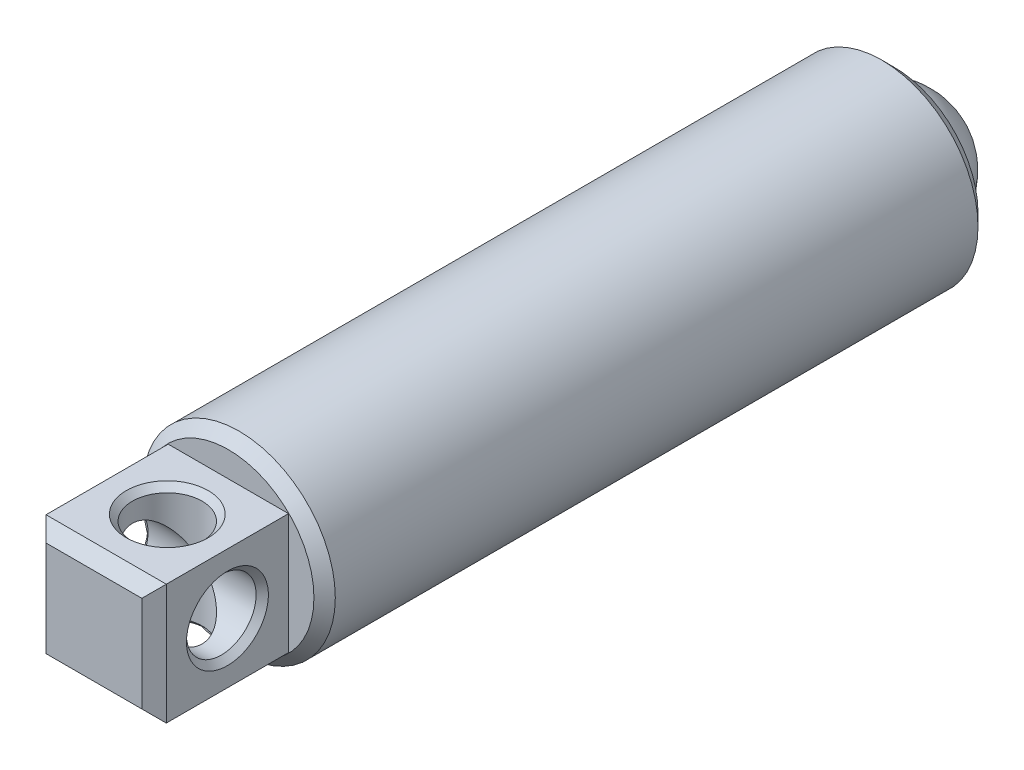
ISO-10303-21;
HEADER;
FILE_DESCRIPTION(('STEP AP214'),'2;1');
FILE_NAME('part.step','',(''),(''),'','','');
FILE_SCHEMA(('AUTOMOTIVE_DESIGN { 1 0 10303 214 1 1 1 1 }'));
ENDSEC;
DATA;
#1=APPLICATION_CONTEXT('core data for automotive mechanical design processes');
#2=APPLICATION_PROTOCOL_DEFINITION('international standard','automotive_design',2000,#1);
#3=PRODUCT_CONTEXT('',#1,'mechanical');
#4=PRODUCT('Part','Part','',(#3));
#5=PRODUCT_RELATED_PRODUCT_CATEGORY('part','',(#4));
#6=PRODUCT_DEFINITION_FORMATION('','',#4);
#7=PRODUCT_DEFINITION_CONTEXT('part definition',#1,'design');
#8=PRODUCT_DEFINITION('design','',#6,#7);
#9=PRODUCT_DEFINITION_SHAPE('','',#8);
#10=(LENGTH_UNIT() NAMED_UNIT(*) SI_UNIT(.MILLI.,.METRE.));
#11=(NAMED_UNIT(*) PLANE_ANGLE_UNIT() SI_UNIT($,.RADIAN.));
#12=(NAMED_UNIT(*) SI_UNIT($,.STERADIAN.) SOLID_ANGLE_UNIT());
#13=UNCERTAINTY_MEASURE_WITH_UNIT(LENGTH_MEASURE(1.E-05),#10,'distance_accuracy_value','');
#14=(GEOMETRIC_REPRESENTATION_CONTEXT(3) GLOBAL_UNCERTAINTY_ASSIGNED_CONTEXT((#13)) GLOBAL_UNIT_ASSIGNED_CONTEXT((#10,
#11,#12)) REPRESENTATION_CONTEXT('',''));
#15=CARTESIAN_POINT('',(0.,0.,0.));
#16=DIRECTION('',(0.,0.,1.));
#17=DIRECTION('',(1.,0.,0.));
#18=AXIS2_PLACEMENT_3D('',#15,#16,#17);
#19=CARTESIAN_POINT('',(1.6625129625254,-2.46036743646982,-6.2258856071015));
#20=DIRECTION('',(0.0490590695989106,0.998795878891222,0.));
#21=DIRECTION('',(-0.998795878891222,0.0490590695989106,0.));
#22=AXIS2_PLACEMENT_3D('',#19,#20,#21);
#23=SPHERICAL_SURFACE('',#22,1.3890625);
#24=CARTESIAN_POINT('',(1.6625129625254,-2.46036743646982,-6.2258856071015));
#25=DIRECTION('',(-0.0490590695989109,-0.998795878891222,0.));
#26=DIRECTION('',(0.,0.,-1.));
#27=AXIS2_PLACEMENT_3D('',#24,#25,#26);
#28=CIRCLE('',#27,1.3890625);
#29=CARTESIAN_POINT('',(0.27512306200306,-2.39222132260509,-6.2258856071015));
#30=VERTEX_POINT('',#29);
#31=CARTESIAN_POINT('',(3.04990286304774,-2.52851355033456,-6.2258856071015));
#32=VERTEX_POINT('',#31);
#33=EDGE_CURVE('P0_E38',#30,#32,#28,.T.);
#34=ORIENTED_EDGE('',*,*,#33,.T.);
#35=CARTESIAN_POINT('',(1.6625129625254,-2.46036743646982,-6.2258856071015));
#36=DIRECTION('',(0.,0.,-1.));
#37=DIRECTION('',(-0.998795878891222,0.0490590695989109,0.));
#38=AXIS2_PLACEMENT_3D('',#35,#36,#37);
#39=CIRCLE('',#38,1.3890625);
#40=EDGE_CURVE('P0_E11',#32,#30,#39,.T.);
#41=ORIENTED_EDGE('',*,*,#40,.T.);
#42=EDGE_LOOP('',(#34,#41));
#43=FACE_BOUND('',#42,.T.);
#44=ADVANCED_FACE('P0_F16',(#43),#23,.T.);
#45=ORIENTED_EDGE('',*,*,#33,.F.);
#46=CARTESIAN_POINT('',(1.6625129625254,-2.46036743646982,-6.2258856071015));
#47=DIRECTION('',(0.,0.,-1.));
#48=DIRECTION('',(-0.998795878891222,0.0490590695989109,0.));
#49=AXIS2_PLACEMENT_3D('',#46,#47,#48);
#50=CIRCLE('',#49,1.3890625);
#51=EDGE_CURVE('P0_E23',#30,#32,#50,.T.);
#52=ORIENTED_EDGE('',*,*,#51,.T.);
#53=EDGE_LOOP('',(#45,#52));
#54=FACE_BOUND('',#53,.T.);
#55=ADVANCED_FACE('P0_F37',(#54),#23,.T.);
#56=ORIENTED_EDGE('',*,*,#40,.F.);
#57=EDGE_CURVE('P0_E34',#32,#30,#28,.T.);
#58=ORIENTED_EDGE('',*,*,#57,.T.);
#59=EDGE_LOOP('',(#56,#58));
#60=FACE_BOUND('',#59,.T.);
#61=ADVANCED_FACE('P0_F32',(#60),#23,.T.);
#62=ORIENTED_EDGE('',*,*,#51,.F.);
#63=ORIENTED_EDGE('',*,*,#57,.F.);
#64=EDGE_LOOP('',(#62,#63));
#65=FACE_BOUND('',#64,.T.);
#66=ADVANCED_FACE('P0_F18',(#65),#23,.T.);
#67=CLOSED_SHELL('',(#44,#55,#61,#66));
#68=MANIFOLD_SOLID_BREP('P0_B1',#67);
#69=CARTESIAN_POINT('',(-0.337483037474602,-2.46036743646982,8.6550518928985));
#70=DIRECTION('',(1.,0.,0.));
#71=DIRECTION('',(0.,0.,-1.));
#72=AXIS2_PLACEMENT_3D('',#69,#70,#71);
#73=CYLINDRICAL_SURFACE('',#72,0.7239);
#74=CARTESIAN_POINT('',(2.7855129625254,-2.46036743646982,8.6550518928985));
#75=DIRECTION('',(-1.,0.,0.));
#76=DIRECTION('',(0.,0.,1.));
#77=AXIS2_PLACEMENT_3D('',#74,#75,#76);
#78=CIRCLE('',#77,0.7239);
#79=CARTESIAN_POINT('',(2.7855129625254,-2.46036743646982,9.3789518928985));
#80=VERTEX_POINT('',#79);
#81=EDGE_CURVE('P1_E119',#80,#80,#78,.F.);
#82=ORIENTED_EDGE('',*,*,#81,.T.);
#83=EDGE_LOOP('',(#82));
#84=FACE_BOUND('',#83,.T.);
#85=CARTESIAN_POINT('',(1.6625129625254,-2.46036743646982,8.6550518928985));
#86=DIRECTION('',(0.707106781186547,-0.707106781186547,0.));
#87=DIRECTION('',(0.707106781186547,0.707106781186547,0.));
#88=AXIS2_PLACEMENT_3D('',#85,#86,#87);
#89=ELLIPSE('',#88,1.02374919780188,0.7239);
#90=CARTESIAN_POINT('',(1.6625129625254,-2.46036743646982,9.3789518928985));
#91=VERTEX_POINT('',#90);
#92=CARTESIAN_POINT('',(1.6625129625254,-2.46036743646982,7.9311518928985));
#93=VERTEX_POINT('',#92);
#94=EDGE_CURVE('P1_E86',#91,#93,#89,.F.);
#95=ORIENTED_EDGE('',*,*,#94,.T.);
#96=CARTESIAN_POINT('',(1.6625129625254,-2.46036743646982,8.6550518928985));
#97=DIRECTION('',(0.707106781186547,0.707106781186547,0.));
#98=DIRECTION('',(0.707106781186547,-0.707106781186547,0.));
#99=AXIS2_PLACEMENT_3D('',#96,#97,#98);
#100=ELLIPSE('',#99,1.02374919780188,0.7239);
#101=EDGE_CURVE('P1_E82',#93,#91,#100,.F.);
#102=ORIENTED_EDGE('',*,*,#101,.T.);
#103=EDGE_LOOP('',(#95,#102));
#104=FACE_BOUND('',#103,.T.);
#105=ADVANCED_FACE('P1_F15',(#84,#104),#73,.F.);
#106=CARTESIAN_POINT('',(1.6625129625254,-0.682367436469824,7.3850518928985));
#107=DIRECTION('',(0.,0.,-1.));
#108=DIRECTION('',(-1.,0.,0.));
#109=AXIS2_PLACEMENT_3D('',#106,#107,#108);
#110=PLANE('',#109);
#111=CARTESIAN_POINT('',(1.6625129625254,-2.46036743646982,7.3850518928985));
#112=DIRECTION('',(0.,0.,1.));
#113=DIRECTION('',(1.,0.,0.));
#114=AXIS2_PLACEMENT_3D('',#111,#112,#113);
#115=CIRCLE('',#114,1.778);
#116=CARTESIAN_POINT('',(3.4405129625254,-2.46036743646982,7.3850518928985));
#117=VERTEX_POINT('',#116);
#118=EDGE_CURVE('P1_E178',#117,#117,#115,.T.);
#119=ORIENTED_EDGE('',*,*,#118,.T.);
#120=EDGE_LOOP('',(#119));
#121=FACE_BOUND('',#120,.T.);
#122=DIRECTION('',(0.,1.,0.));
#123=VECTOR('',#122,1.);
#124=CARTESIAN_POINT('',(2.9125129625254,-3.71036743646982,7.3850518928985));
#125=LINE('',#124,#123);
#126=CARTESIAN_POINT('',(2.9125129625254,-3.71036743646982,7.3850518928985));
#127=VERTEX_POINT('',#126);
#128=CARTESIAN_POINT('',(2.9125129625254,-1.21036743646982,7.3850518928985));
#129=VERTEX_POINT('',#128);
#130=EDGE_CURVE('P1_E152',#127,#129,#125,.T.);
#131=ORIENTED_EDGE('',*,*,#130,.F.);
#132=DIRECTION('',(1.,0.,0.));
#133=VECTOR('',#132,1.);
#134=CARTESIAN_POINT('',(0.412512962525397,-3.71036743646982,7.3850518928985));
#135=LINE('',#134,#133);
#136=CARTESIAN_POINT('',(0.412512962525397,-3.71036743646982,7.3850518928985));
#137=VERTEX_POINT('',#136);
#138=EDGE_CURVE('P1_E167',#137,#127,#135,.T.);
#139=ORIENTED_EDGE('',*,*,#138,.F.);
#140=DIRECTION('',(0.,-1.,0.));
#141=VECTOR('',#140,1.);
#142=CARTESIAN_POINT('',(0.412512962525397,-3.71036743646982,7.3850518928985));
#143=LINE('',#142,#141);
#144=CARTESIAN_POINT('',(0.412512962525397,-1.21036743646982,7.3850518928985));
#145=VERTEX_POINT('',#144);
#146=EDGE_CURVE('P1_E162',#145,#137,#143,.T.);
#147=ORIENTED_EDGE('',*,*,#146,.F.);
#148=DIRECTION('',(-1.,0.,0.));
#149=VECTOR('',#148,1.);
#150=CARTESIAN_POINT('',(0.412512962525397,-1.21036743646982,7.3850518928985));
#151=LINE('',#150,#149);
#152=EDGE_CURVE('P1_E157',#129,#145,#151,.T.);
#153=ORIENTED_EDGE('',*,*,#152,.F.);
#154=EDGE_LOOP('',(#131,#139,#147,#153));
#155=FACE_BOUND('',#154,.T.);
#156=ADVANCED_FACE('P1_F195',(#121,#155),#110,.F.);
#157=CARTESIAN_POINT('',(1.6625129625254,-2.46036743646982,-4.26145458061761));
#158=DIRECTION('',(0.,0.,-1.));
#159=DIRECTION('',(-1.,0.,0.));
#160=AXIS2_PLACEMENT_3D('',#157,#158,#159);
#161=CONICAL_SURFACE('',#160,0.,0.785398163397444);
#162=CARTESIAN_POINT('',(1.6625129625254,-2.46036743646982,-5.65845458061762));
#163=DIRECTION('',(0.,0.,1.));
#164=DIRECTION('',(1.,0.,0.));
#165=AXIS2_PLACEMENT_3D('',#162,#163,#164);
#166=CIRCLE('',#165,1.397);
#167=CARTESIAN_POINT('',(3.0595129625254,-2.46036743646982,-5.65845458061762));
#168=VERTEX_POINT('',#167);
#169=EDGE_CURVE('P1_E92',#168,#168,#166,.T.);
#170=ORIENTED_EDGE('',*,*,#169,.F.);
#171=EDGE_LOOP('',(#170));
#172=FACE_BOUND('',#171,.T.);
#173=CARTESIAN_POINT('',(1.6625129625254,-2.46036743646982,-4.26145458061761));
#174=VERTEX_POINT('',#173);
#175=VERTEX_LOOP('',#174);
#176=FACE_BOUND('',#175,.T.);
#177=ADVANCED_FACE('P1_F192',(#172,#176),#161,.F.);
#178=CARTESIAN_POINT('',(1.6625129625254,-2.46036743646982,7.3850518928985));
#179=DIRECTION('',(0.,0.,1.));
#180=DIRECTION('',(1.,0.,0.));
#181=AXIS2_PLACEMENT_3D('',#178,#179,#180);
#182=CYLINDRICAL_SURFACE('',#181,1.397);
#183=CARTESIAN_POINT('',(1.6625129625254,-2.46036743646982,-6.4465481071015));
#184=DIRECTION('',(0.,0.,1.));
#185=DIRECTION('',(1.,0.,0.));
#186=AXIS2_PLACEMENT_3D('',#183,#184,#185);
#187=CIRCLE('',#186,1.397);
#188=CARTESIAN_POINT('',(3.0595129625254,-2.46036743646982,-6.4465481071015));
#189=VERTEX_POINT('',#188);
#190=EDGE_CURVE('P1_E184',#189,#189,#187,.T.);
#191=ORIENTED_EDGE('',*,*,#190,.F.);
#192=EDGE_LOOP('',(#191));
#193=FACE_BOUND('',#192,.T.);
#194=ORIENTED_EDGE('',*,*,#169,.T.);
#195=EDGE_LOOP('',(#194));
#196=FACE_BOUND('',#195,.T.);
#197=ADVANCED_FACE('P1_F190',(#193,#196),#182,.F.);
#198=CARTESIAN_POINT('',(1.6625129625254,-0.460371436469824,-6.4465481071015));
#199=DIRECTION('',(0.,0.,1.));
#200=DIRECTION('',(1.,0.,0.));
#201=AXIS2_PLACEMENT_3D('',#198,#199,#200);
#202=PLANE('',#201);
#203=CARTESIAN_POINT('',(1.6625129625254,-2.46036743646982,-6.4465481071015));
#204=DIRECTION('',(0.,0.,1.));
#205=DIRECTION('',(1.,0.,0.));
#206=AXIS2_PLACEMENT_3D('',#203,#204,#205);
#207=CIRCLE('',#206,1.745996);
#208=CARTESIAN_POINT('',(3.4085089625254,-2.46036743646982,-6.4465481071015));
#209=VERTEX_POINT('',#208);
#210=EDGE_CURVE('P1_E101',#209,#209,#207,.F.);
#211=ORIENTED_EDGE('',*,*,#210,.T.);
#212=EDGE_LOOP('',(#211));
#213=FACE_BOUND('',#212,.T.);
#214=ORIENTED_EDGE('',*,*,#190,.T.);
#215=EDGE_LOOP('',(#214));
#216=FACE_BOUND('',#215,.T.);
#217=ADVANCED_FACE('P1_F202',(#213,#216),#202,.F.);
#218=CARTESIAN_POINT('',(1.6625129625254,-2.46036743646982,7.3850518928985));
#219=DIRECTION('',(0.,0.,1.));
#220=DIRECTION('',(1.,0.,0.));
#221=AXIS2_PLACEMENT_3D('',#218,#219,#220);
#222=CYLINDRICAL_SURFACE('',#221,1.999996);
#223=CARTESIAN_POINT('',(1.6625129625254,-2.46036743646982,-6.1925481071015));
#224=DIRECTION('',(0.,0.,1.));
#225=DIRECTION('',(1.,0.,0.));
#226=AXIS2_PLACEMENT_3D('',#223,#224,#225);
#227=CIRCLE('',#226,1.999996);
#228=CARTESIAN_POINT('',(3.6625089625254,-2.46036743646982,-6.1925481071015));
#229=VERTEX_POINT('',#228);
#230=EDGE_CURVE('P1_E94',#229,#229,#227,.T.);
#231=ORIENTED_EDGE('',*,*,#230,.T.);
#232=EDGE_LOOP('',(#231));
#233=FACE_BOUND('',#232,.T.);
#234=CARTESIAN_POINT('',(1.6625129625254,-2.46036743646982,7.1630558928985));
#235=DIRECTION('',(0.,0.,1.));
#236=DIRECTION('',(1.,0.,0.));
#237=AXIS2_PLACEMENT_3D('',#234,#235,#236);
#238=CIRCLE('',#237,1.999996);
#239=CARTESIAN_POINT('',(3.6625089625254,-2.46036743646982,7.1630558928985));
#240=VERTEX_POINT('',#239);
#241=EDGE_CURVE('P1_E181',#240,#240,#238,.T.);
#242=ORIENTED_EDGE('',*,*,#241,.F.);
#243=EDGE_LOOP('',(#242));
#244=FACE_BOUND('',#243,.T.);
#245=ADVANCED_FACE('P1_F285',(#233,#244),#222,.T.);
#246=CARTESIAN_POINT('',(1.6625129625254,-2.46036743646982,7.1630558928985));
#247=DIRECTION('',(0.,0.,-1.));
#248=DIRECTION('',(-1.,0.,0.));
#249=AXIS2_PLACEMENT_3D('',#246,#247,#248);
#250=CONICAL_SURFACE('',#249,1.999996,0.78539816339745);
#251=ORIENTED_EDGE('',*,*,#118,.F.);
#252=EDGE_LOOP('',(#251));
#253=FACE_BOUND('',#252,.T.);
#254=ORIENTED_EDGE('',*,*,#241,.T.);
#255=EDGE_LOOP('',(#254));
#256=FACE_BOUND('',#255,.T.);
#257=ADVANCED_FACE('P1_F288',(#253,#256),#250,.T.);
#258=CARTESIAN_POINT('',(2.9125129625254,-3.71036743646982,10.1790518928985));
#259=DIRECTION('',(-1.,0.,0.));
#260=DIRECTION('',(0.,0.,1.));
#261=AXIS2_PLACEMENT_3D('',#258,#259,#260);
#262=PLANE('',#261);
#263=CARTESIAN_POINT('',(2.9125129625254,-2.46036743646982,8.6550518928985));
#264=DIRECTION('',(-1.,0.,0.));
#265=DIRECTION('',(0.,0.,1.));
#266=AXIS2_PLACEMENT_3D('',#263,#264,#265);
#267=CIRCLE('',#266,0.850899999999996);
#268=CARTESIAN_POINT('',(2.9125129625254,-2.46036743646982,9.5059518928985));
#269=VERTEX_POINT('',#268);
#270=EDGE_CURVE('P1_E116',#269,#269,#267,.T.);
#271=ORIENTED_EDGE('',*,*,#270,.T.);
#272=EDGE_LOOP('',(#271));
#273=FACE_BOUND('',#272,.T.);
#274=DIRECTION('',(0.,0.,-1.));
#275=VECTOR('',#274,1.);
#276=CARTESIAN_POINT('',(2.9125129625254,-1.21036743646982,10.1790518928985));
#277=LINE('',#276,#275);
#278=CARTESIAN_POINT('',(2.9125129625254,-1.21036743646982,9.9250518928985));
#279=VERTEX_POINT('',#278);
#280=EDGE_CURVE('P1_E176',#279,#129,#277,.T.);
#281=ORIENTED_EDGE('',*,*,#280,.F.);
#282=DIRECTION('',(0.,-1.,0.));
#283=VECTOR('',#282,1.);
#284=CARTESIAN_POINT('',(2.9125129625254,-3.71036743646982,9.9250518928985));
#285=LINE('',#284,#283);
#286=CARTESIAN_POINT('',(2.9125129625254,-3.71036743646982,9.9250518928985));
#287=VERTEX_POINT('',#286);
#288=EDGE_CURVE('P1_E10',#279,#287,#285,.T.);
#289=ORIENTED_EDGE('',*,*,#288,.T.);
#290=DIRECTION('',(0.,0.,-1.));
#291=VECTOR('',#290,1.);
#292=CARTESIAN_POINT('',(2.9125129625254,-3.71036743646982,10.1790518928985));
#293=LINE('',#292,#291);
#294=EDGE_CURVE('P1_E170',#287,#127,#293,.T.);
#295=ORIENTED_EDGE('',*,*,#294,.T.);
#296=ORIENTED_EDGE('',*,*,#130,.T.);
#297=EDGE_LOOP('',(#281,#289,#295,#296));
#298=FACE_BOUND('',#297,.T.);
#299=ADVANCED_FACE('P1_F245',(#273,#298),#262,.F.);
#300=CARTESIAN_POINT('',(0.412512962525397,-1.21036743646982,10.1790518928985));
#301=DIRECTION('',(0.,-1.,0.));
#302=DIRECTION('',(0.,0.,-1.));
#303=AXIS2_PLACEMENT_3D('',#300,#301,#302);
#304=PLANE('',#303);
#305=CARTESIAN_POINT('',(1.6625129625254,-1.21036743646982,8.6550518928985));
#306=DIRECTION('',(0.,-1.,0.));
#307=DIRECTION('',(0.,0.,-1.));
#308=AXIS2_PLACEMENT_3D('',#305,#306,#307);
#309=CIRCLE('',#308,0.850899999999996);
#310=CARTESIAN_POINT('',(1.6625129625254,-1.21036743646982,7.8041518928985));
#311=VERTEX_POINT('',#310);
#312=EDGE_CURVE('P1_E122',#311,#311,#309,.T.);
#313=ORIENTED_EDGE('',*,*,#312,.T.);
#314=EDGE_LOOP('',(#313));
#315=FACE_BOUND('',#314,.T.);
#316=DIRECTION('',(0.,0.,-1.));
#317=VECTOR('',#316,1.);
#318=CARTESIAN_POINT('',(0.412512962525397,-1.21036743646982,10.1790518928985));
#319=LINE('',#318,#317);
#320=CARTESIAN_POINT('',(0.412512962525397,-1.21036743646982,9.9250518928985));
#321=VERTEX_POINT('',#320);
#322=EDGE_CURVE('P1_E174',#321,#145,#319,.T.);
#323=ORIENTED_EDGE('',*,*,#322,.F.);
#324=DIRECTION('',(1.,0.,0.));
#325=VECTOR('',#324,1.);
#326=CARTESIAN_POINT('',(0.412512962525397,-1.21036743646982,9.9250518928985));
#327=LINE('',#326,#325);
#328=EDGE_CURVE('P1_E24',#321,#279,#327,.T.);
#329=ORIENTED_EDGE('',*,*,#328,.T.);
#330=ORIENTED_EDGE('',*,*,#280,.T.);
#331=ORIENTED_EDGE('',*,*,#152,.T.);
#332=EDGE_LOOP('',(#323,#329,#330,#331));
#333=FACE_BOUND('',#332,.T.);
#334=ADVANCED_FACE('P1_F236',(#315,#333),#304,.F.);
#335=CARTESIAN_POINT('',(0.412512962525397,-3.71036743646982,10.1790518928985));
#336=DIRECTION('',(1.,0.,0.));
#337=DIRECTION('',(0.,0.,-1.));
#338=AXIS2_PLACEMENT_3D('',#335,#336,#337);
#339=PLANE('',#338);
#340=CARTESIAN_POINT('',(0.412512962525397,-2.46036743646982,8.6550518928985));
#341=DIRECTION('',(1.,0.,0.));
#342=DIRECTION('',(0.,0.,-1.));
#343=AXIS2_PLACEMENT_3D('',#340,#341,#342);
#344=CIRCLE('',#343,0.850899999999995);
#345=CARTESIAN_POINT('',(0.412512962525397,-2.46036743646982,7.80415189289851));
#346=VERTEX_POINT('',#345);
#347=EDGE_CURVE('P1_E104',#346,#346,#344,.T.);
#348=ORIENTED_EDGE('',*,*,#347,.T.);
#349=EDGE_LOOP('',(#348));
#350=FACE_BOUND('',#349,.T.);
#351=DIRECTION('',(0.,0.,-1.));
#352=VECTOR('',#351,1.);
#353=CARTESIAN_POINT('',(0.412512962525397,-3.71036743646982,10.1790518928985));
#354=LINE('',#353,#352);
#355=CARTESIAN_POINT('',(0.412512962525397,-3.71036743646982,9.9250518928985));
#356=VERTEX_POINT('',#355);
#357=EDGE_CURVE('P1_E172',#356,#137,#354,.T.);
#358=ORIENTED_EDGE('',*,*,#357,.F.);
#359=DIRECTION('',(0.,1.,0.));
#360=VECTOR('',#359,1.);
#361=CARTESIAN_POINT('',(0.412512962525397,-3.71036743646982,9.9250518928985));
#362=LINE('',#361,#360);
#363=EDGE_CURVE('P1_E39',#356,#321,#362,.T.);
#364=ORIENTED_EDGE('',*,*,#363,.T.);
#365=ORIENTED_EDGE('',*,*,#322,.T.);
#366=ORIENTED_EDGE('',*,*,#146,.T.);
#367=EDGE_LOOP('',(#358,#364,#365,#366));
#368=FACE_BOUND('',#367,.T.);
#369=ADVANCED_FACE('P1_F234',(#350,#368),#339,.F.);
#370=CARTESIAN_POINT('',(0.412512962525397,-3.71036743646982,10.1790518928985));
#371=DIRECTION('',(0.,1.,0.));
#372=DIRECTION('',(0.,0.,1.));
#373=AXIS2_PLACEMENT_3D('',#370,#371,#372);
#374=PLANE('',#373);
#375=CARTESIAN_POINT('',(1.6625129625254,-3.71036743646982,8.6550518928985));
#376=DIRECTION('',(0.,1.,0.));
#377=DIRECTION('',(0.,0.,1.));
#378=AXIS2_PLACEMENT_3D('',#375,#376,#377);
#379=CIRCLE('',#378,0.8509);
#380=CARTESIAN_POINT('',(1.6625129625254,-3.71036743646982,9.5059518928985));
#381=VERTEX_POINT('',#380);
#382=EDGE_CURVE('P1_E110',#381,#381,#379,.T.);
#383=ORIENTED_EDGE('',*,*,#382,.T.);
#384=EDGE_LOOP('',(#383));
#385=FACE_BOUND('',#384,.T.);
#386=ORIENTED_EDGE('',*,*,#294,.F.);
#387=DIRECTION('',(-1.,0.,0.));
#388=VECTOR('',#387,1.);
#389=CARTESIAN_POINT('',(0.412512962525397,-3.71036743646982,9.9250518928985));
#390=LINE('',#389,#388);
#391=EDGE_CURVE('P1_E137',#287,#356,#390,.T.);
#392=ORIENTED_EDGE('',*,*,#391,.T.);
#393=ORIENTED_EDGE('',*,*,#357,.T.);
#394=ORIENTED_EDGE('',*,*,#138,.T.);
#395=EDGE_LOOP('',(#386,#392,#393,#394));
#396=FACE_BOUND('',#395,.T.);
#397=ADVANCED_FACE('P1_F222',(#385,#396),#374,.F.);
#398=CARTESIAN_POINT('',(1.6625129625254,-2.46036743646982,10.1790518928985));
#399=DIRECTION('',(0.,0.,-1.));
#400=DIRECTION('',(-1.,0.,0.));
#401=AXIS2_PLACEMENT_3D('',#398,#399,#400);
#402=PLANE('',#401);
#403=DIRECTION('',(0.,-1.,0.));
#404=VECTOR('',#403,1.);
#405=CARTESIAN_POINT('',(0.666512962525394,-2.46036743646982,10.1790518928985));
#406=LINE('',#405,#404);
#407=CARTESIAN_POINT('',(0.666512962525394,-1.46436743646982,10.1790518928985));
#408=VERTEX_POINT('',#407);
#409=CARTESIAN_POINT('',(0.666512962525394,-3.45636743646983,10.1790518928985));
#410=VERTEX_POINT('',#409);
#411=EDGE_CURVE('P1_E132',#408,#410,#406,.T.);
#412=ORIENTED_EDGE('',*,*,#411,.T.);
#413=DIRECTION('',(1.,0.,0.));
#414=VECTOR('',#413,1.);
#415=CARTESIAN_POINT('',(1.6625129625254,-3.45636743646983,10.1790518928985));
#416=LINE('',#415,#414);
#417=CARTESIAN_POINT('',(2.6585129625254,-3.45636743646983,10.1790518928985));
#418=VERTEX_POINT('',#417);
#419=EDGE_CURVE('P1_E134',#410,#418,#416,.T.);
#420=ORIENTED_EDGE('',*,*,#419,.T.);
#421=DIRECTION('',(0.,1.,0.));
#422=VECTOR('',#421,1.);
#423=CARTESIAN_POINT('',(2.6585129625254,-2.46036743646982,10.1790518928985));
#424=LINE('',#423,#422);
#425=CARTESIAN_POINT('',(2.6585129625254,-1.46436743646982,10.1790518928985));
#426=VERTEX_POINT('',#425);
#427=EDGE_CURVE('P1_E128',#418,#426,#424,.T.);
#428=ORIENTED_EDGE('',*,*,#427,.T.);
#429=DIRECTION('',(-1.,0.,0.));
#430=VECTOR('',#429,1.);
#431=CARTESIAN_POINT('',(1.6625129625254,-1.46436743646982,10.1790518928985));
#432=LINE('',#431,#430);
#433=EDGE_CURVE('P1_E130',#426,#408,#432,.T.);
#434=ORIENTED_EDGE('',*,*,#433,.T.);
#435=EDGE_LOOP('',(#412,#420,#428,#434));
#436=FACE_BOUND('',#435,.T.);
#437=ADVANCED_FACE('P1_F215',(#436),#402,.F.);
#438=CARTESIAN_POINT('',(0.539512962525391,-2.46036743646982,8.6550518928985));
#439=DIRECTION('',(1.,0.,0.));
#440=DIRECTION('',(0.,0.,-1.));
#441=AXIS2_PLACEMENT_3D('',#438,#439,#440);
#442=CIRCLE('',#441,0.7239);
#443=CARTESIAN_POINT('',(0.539512962525391,-2.46036743646982,7.9311518928985));
#444=VERTEX_POINT('',#443);
#445=EDGE_CURVE('P1_E107',#444,#444,#442,.F.);
#446=ORIENTED_EDGE('',*,*,#445,.T.);
#447=EDGE_LOOP('',(#446));
#448=FACE_BOUND('',#447,.T.);
#449=CARTESIAN_POINT('',(1.6625129625254,-2.46036743646982,8.6550518928985));
#450=DIRECTION('',(0.707106781186547,-0.707106781186547,0.));
#451=DIRECTION('',(0.707106781186547,0.707106781186547,0.));
#452=AXIS2_PLACEMENT_3D('',#449,#450,#451);
#453=ELLIPSE('',#452,1.02374919780188,0.7239);
#454=EDGE_CURVE('P1_E78',#91,#93,#453,.T.);
#455=ORIENTED_EDGE('',*,*,#454,.T.);
#456=CARTESIAN_POINT('',(1.6625129625254,-2.46036743646982,8.6550518928985));
#457=DIRECTION('',(0.707106781186547,0.707106781186547,0.));
#458=DIRECTION('',(0.707106781186547,-0.707106781186547,0.));
#459=AXIS2_PLACEMENT_3D('',#456,#457,#458);
#460=ELLIPSE('',#459,1.02374919780188,0.7239);
#461=EDGE_CURVE('P1_E85',#93,#91,#460,.T.);
#462=ORIENTED_EDGE('',*,*,#461,.T.);
#463=EDGE_LOOP('',(#455,#462));
#464=FACE_BOUND('',#463,.T.);
#465=ADVANCED_FACE('P1_F96',(#448,#464),#73,.F.);
#466=CARTESIAN_POINT('',(1.6625129625254,-4.46036343646982,8.6550518928985));
#467=DIRECTION('',(0.,1.,0.));
#468=DIRECTION('',(0.,0.,1.));
#469=AXIS2_PLACEMENT_3D('',#466,#467,#468);
#470=CYLINDRICAL_SURFACE('',#469,0.7239);
#471=CARTESIAN_POINT('',(1.6625129625254,-1.33736743646982,8.6550518928985));
#472=DIRECTION('',(0.,-1.,0.));
#473=DIRECTION('',(0.,0.,-1.));
#474=AXIS2_PLACEMENT_3D('',#471,#472,#473);
#475=CIRCLE('',#474,0.7239);
#476=CARTESIAN_POINT('',(1.6625129625254,-1.33736743646982,7.9311518928985));
#477=VERTEX_POINT('',#476);
#478=EDGE_CURVE('P1_E125',#477,#477,#475,.F.);
#479=ORIENTED_EDGE('',*,*,#478,.T.);
#480=EDGE_LOOP('',(#479));
#481=FACE_BOUND('',#480,.T.);
#482=ORIENTED_EDGE('',*,*,#94,.F.);
#483=ORIENTED_EDGE('',*,*,#461,.F.);
#484=EDGE_LOOP('',(#482,#483));
#485=FACE_BOUND('',#484,.T.);
#486=ADVANCED_FACE('P1_F90',(#481,#485),#470,.F.);
#487=CARTESIAN_POINT('',(1.6625129625254,-3.58336743646982,8.6550518928985));
#488=DIRECTION('',(0.,1.,0.));
#489=DIRECTION('',(0.,0.,1.));
#490=AXIS2_PLACEMENT_3D('',#487,#488,#489);
#491=CIRCLE('',#490,0.7239);
#492=CARTESIAN_POINT('',(1.6625129625254,-3.58336743646982,9.3789518928985));
#493=VERTEX_POINT('',#492);
#494=EDGE_CURVE('P1_E113',#493,#493,#491,.F.);
#495=ORIENTED_EDGE('',*,*,#494,.T.);
#496=EDGE_LOOP('',(#495));
#497=FACE_BOUND('',#496,.T.);
#498=ORIENTED_EDGE('',*,*,#454,.F.);
#499=ORIENTED_EDGE('',*,*,#101,.F.);
#500=EDGE_LOOP('',(#498,#499));
#501=FACE_BOUND('',#500,.T.);
#502=ADVANCED_FACE('P1_F80',(#497,#501),#470,.F.);
#503=CARTESIAN_POINT('',(1.6625129625254,-2.46036743646982,-6.1925481071015));
#504=DIRECTION('',(0.,0.,1.));
#505=DIRECTION('',(1.,0.,0.));
#506=AXIS2_PLACEMENT_3D('',#503,#504,#505);
#507=CONICAL_SURFACE('',#506,1.999996,0.785398163397454);
#508=ORIENTED_EDGE('',*,*,#210,.F.);
#509=EDGE_LOOP('',(#508));
#510=FACE_BOUND('',#509,.T.);
#511=ORIENTED_EDGE('',*,*,#230,.F.);
#512=EDGE_LOOP('',(#511));
#513=FACE_BOUND('',#512,.T.);
#514=ADVANCED_FACE('P1_F230',(#510,#513),#507,.T.);
#515=CARTESIAN_POINT('',(0.412512962525397,-2.46036743646982,8.6550518928985));
#516=DIRECTION('',(-1.,0.,0.));
#517=DIRECTION('',(0.,0.,1.));
#518=AXIS2_PLACEMENT_3D('',#515,#516,#517);
#519=CONICAL_SURFACE('',#518,0.850899999999995,0.78539816339745);
#520=ORIENTED_EDGE('',*,*,#445,.F.);
#521=EDGE_LOOP('',(#520));
#522=FACE_BOUND('',#521,.T.);
#523=ORIENTED_EDGE('',*,*,#347,.F.);
#524=EDGE_LOOP('',(#523));
#525=FACE_BOUND('',#524,.T.);
#526=ADVANCED_FACE('P1_F226',(#522,#525),#519,.F.);
#527=CARTESIAN_POINT('',(1.6625129625254,-3.71036743646982,8.6550518928985));
#528=DIRECTION('',(0.,-1.,0.));
#529=DIRECTION('',(0.,0.,-1.));
#530=AXIS2_PLACEMENT_3D('',#527,#528,#529);
#531=CONICAL_SURFACE('',#530,0.8509,0.785398163397451);
#532=ORIENTED_EDGE('',*,*,#494,.F.);
#533=EDGE_LOOP('',(#532));
#534=FACE_BOUND('',#533,.T.);
#535=ORIENTED_EDGE('',*,*,#382,.F.);
#536=EDGE_LOOP('',(#535));
#537=FACE_BOUND('',#536,.T.);
#538=ADVANCED_FACE('P1_F229',(#534,#537),#531,.F.);
#539=CARTESIAN_POINT('',(2.9125129625254,-2.46036743646982,8.6550518928985));
#540=DIRECTION('',(1.,0.,0.));
#541=DIRECTION('',(0.,0.,-1.));
#542=AXIS2_PLACEMENT_3D('',#539,#540,#541);
#543=CONICAL_SURFACE('',#542,0.850899999999996,0.785398163397444);
#544=ORIENTED_EDGE('',*,*,#81,.F.);
#545=EDGE_LOOP('',(#544));
#546=FACE_BOUND('',#545,.T.);
#547=ORIENTED_EDGE('',*,*,#270,.F.);
#548=EDGE_LOOP('',(#547));
#549=FACE_BOUND('',#548,.T.);
#550=ADVANCED_FACE('P1_F267',(#546,#549),#543,.F.);
#551=CARTESIAN_POINT('',(1.6625129625254,-1.21036743646982,8.6550518928985));
#552=DIRECTION('',(0.,1.,0.));
#553=DIRECTION('',(0.,0.,1.));
#554=AXIS2_PLACEMENT_3D('',#551,#552,#553);
#555=CONICAL_SURFACE('',#554,0.850899999999996,0.785398163397445);
#556=ORIENTED_EDGE('',*,*,#478,.F.);
#557=EDGE_LOOP('',(#556));
#558=FACE_BOUND('',#557,.T.);
#559=ORIENTED_EDGE('',*,*,#312,.F.);
#560=EDGE_LOOP('',(#559));
#561=FACE_BOUND('',#560,.T.);
#562=ADVANCED_FACE('P1_F261',(#558,#561),#555,.F.);
#563=CARTESIAN_POINT('',(1.6625129625254,-1.46436743646982,10.1790518928985));
#564=DIRECTION('',(0.,-0.70710678118655,-0.707106781186545));
#565=DIRECTION('',(-1.,0.,0.));
#566=AXIS2_PLACEMENT_3D('',#563,#564,#565);
#567=PLANE('',#566);
#568=DIRECTION('',(-0.577350269189624,-0.577350269189624,0.577350269189628));
#569=VECTOR('',#568,1.);
#570=CARTESIAN_POINT('',(2.3265129625254,-1.79636743646982,10.5110518928985));
#571=LINE('',#570,#569);
#572=EDGE_CURVE('P1_E145',#279,#426,#571,.T.);
#573=ORIENTED_EDGE('',*,*,#572,.F.);
#574=ORIENTED_EDGE('',*,*,#328,.F.);
#575=DIRECTION('',(0.577350269189624,-0.577350269189624,0.577350269189628));
#576=VECTOR('',#575,1.);
#577=CARTESIAN_POINT('',(0.998512962525394,-1.79636743646982,10.5110518928985));
#578=LINE('',#577,#576);
#579=EDGE_CURVE('P1_E19',#408,#321,#578,.F.);
#580=ORIENTED_EDGE('',*,*,#579,.F.);
#581=ORIENTED_EDGE('',*,*,#433,.F.);
#582=EDGE_LOOP('',(#573,#574,#580,#581));
#583=FACE_BOUND('',#582,.T.);
#584=ADVANCED_FACE('P1_F17',(#583),#567,.F.);
#585=CARTESIAN_POINT('',(0.666512962525394,-2.46036743646982,10.1790518928985));
#586=DIRECTION('',(0.70710678118655,0.,-0.707106781186545));
#587=DIRECTION('',(0.,-1.,0.));
#588=AXIS2_PLACEMENT_3D('',#585,#586,#587);
#589=PLANE('',#588);
#590=ORIENTED_EDGE('',*,*,#579,.T.);
#591=ORIENTED_EDGE('',*,*,#363,.F.);
#592=DIRECTION('',(0.577350269189624,0.577350269189624,0.577350269189628));
#593=VECTOR('',#592,1.);
#594=CARTESIAN_POINT('',(0.998512962525394,-3.12436743646983,10.5110518928985));
#595=LINE('',#594,#593);
#596=EDGE_CURVE('P1_E144',#410,#356,#595,.F.);
#597=ORIENTED_EDGE('',*,*,#596,.F.);
#598=ORIENTED_EDGE('',*,*,#411,.F.);
#599=EDGE_LOOP('',(#590,#591,#597,#598));
#600=FACE_BOUND('',#599,.T.);
#601=ADVANCED_FACE('P1_F254',(#600),#589,.F.);
#602=CARTESIAN_POINT('',(2.6585129625254,-2.46036743646982,10.1790518928985));
#603=DIRECTION('',(-0.70710678118655,0.,-0.707106781186545));
#604=DIRECTION('',(0.,1.,0.));
#605=AXIS2_PLACEMENT_3D('',#602,#603,#604);
#606=PLANE('',#605);
#607=ORIENTED_EDGE('',*,*,#572,.T.);
#608=ORIENTED_EDGE('',*,*,#427,.F.);
#609=DIRECTION('',(0.577350269189624,-0.577350269189624,-0.577350269189628));
#610=VECTOR('',#609,1.);
#611=CARTESIAN_POINT('',(2.3265129625254,-3.12436743646983,10.5110518928985));
#612=LINE('',#611,#610);
#613=EDGE_CURVE('P1_E142',#287,#418,#612,.F.);
#614=ORIENTED_EDGE('',*,*,#613,.F.);
#615=ORIENTED_EDGE('',*,*,#288,.F.);
#616=EDGE_LOOP('',(#607,#608,#614,#615));
#617=FACE_BOUND('',#616,.T.);
#618=ADVANCED_FACE('P1_F249',(#617),#606,.F.);
#619=CARTESIAN_POINT('',(1.6625129625254,-3.45636743646983,10.1790518928985));
#620=DIRECTION('',(0.,0.70710678118655,-0.707106781186545));
#621=DIRECTION('',(1.,0.,0.));
#622=AXIS2_PLACEMENT_3D('',#619,#620,#621);
#623=PLANE('',#622);
#624=ORIENTED_EDGE('',*,*,#596,.T.);
#625=ORIENTED_EDGE('',*,*,#391,.F.);
#626=ORIENTED_EDGE('',*,*,#613,.T.);
#627=ORIENTED_EDGE('',*,*,#419,.F.);
#628=EDGE_LOOP('',(#624,#625,#626,#627));
#629=FACE_BOUND('',#628,.T.);
#630=ADVANCED_FACE('P1_F252',(#629),#623,.F.);
#631=CLOSED_SHELL('',(#105,#156,#177,#197,#217,#245,#257,#299,#334,#369,#397,#437,#465,#486,
#502,#514,#526,#538,#550,#562,#584,#601,#618,#630));
#632=MANIFOLD_SOLID_BREP('P1_B1',#631);
#633=ADVANCED_BREP_SHAPE_REPRESENTATION('',(#18,#68,#632),#14);
#634=SHAPE_DEFINITION_REPRESENTATION(#9,#633);
ENDSEC;
END-ISO-10303-21;
